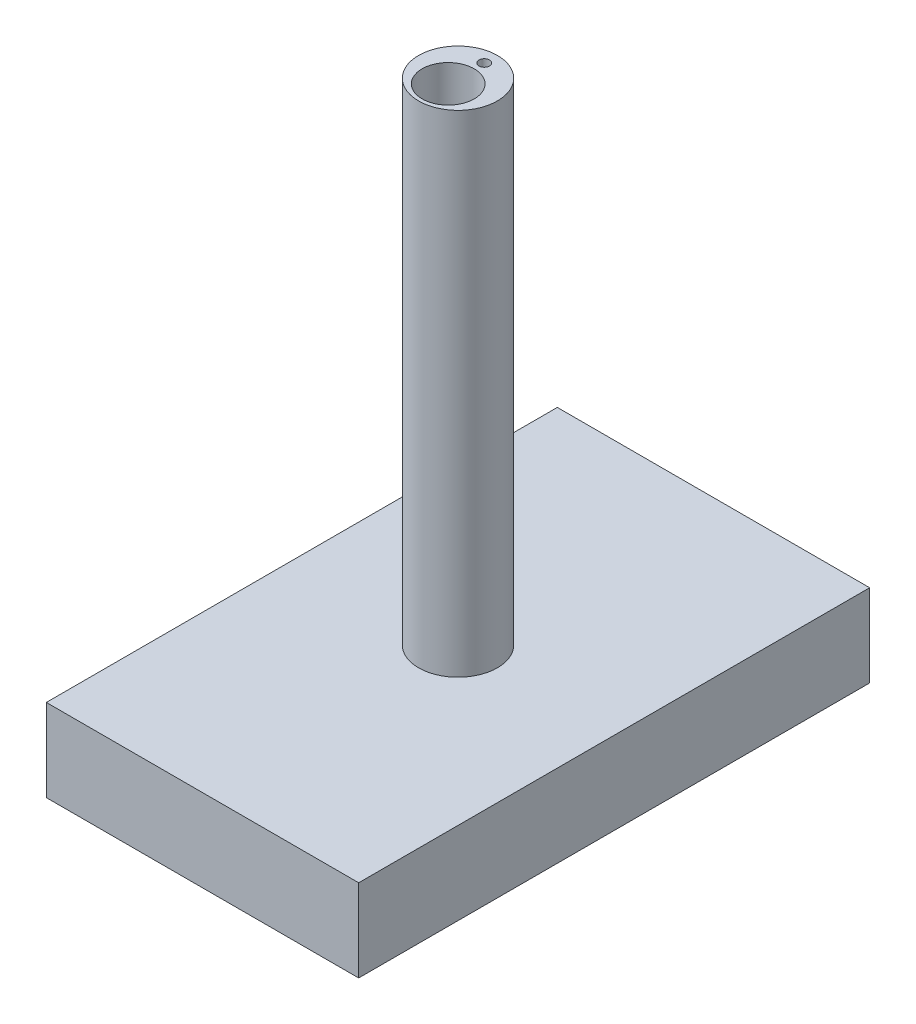
ISO-10303-21;
HEADER;
FILE_DESCRIPTION(('STEP AP214'),'2;1');
FILE_NAME('part.step','',(''),(''),'','','');
FILE_SCHEMA(('AUTOMOTIVE_DESIGN { 1 0 10303 214 1 1 1 1 }'));
ENDSEC;
DATA;
#1=APPLICATION_CONTEXT('core data for automotive mechanical design processes');
#2=APPLICATION_PROTOCOL_DEFINITION('international standard','automotive_design',2000,#1);
#3=PRODUCT_CONTEXT('',#1,'mechanical');
#4=PRODUCT('Part','Part','',(#3));
#5=PRODUCT_RELATED_PRODUCT_CATEGORY('part','',(#4));
#6=PRODUCT_DEFINITION_FORMATION('','',#4);
#7=PRODUCT_DEFINITION_CONTEXT('part definition',#1,'design');
#8=PRODUCT_DEFINITION('design','',#6,#7);
#9=PRODUCT_DEFINITION_SHAPE('','',#8);
#10=(LENGTH_UNIT() NAMED_UNIT(*) SI_UNIT(.MILLI.,.METRE.));
#11=(NAMED_UNIT(*) PLANE_ANGLE_UNIT() SI_UNIT($,.RADIAN.));
#12=(NAMED_UNIT(*) SI_UNIT($,.STERADIAN.) SOLID_ANGLE_UNIT());
#13=UNCERTAINTY_MEASURE_WITH_UNIT(LENGTH_MEASURE(1.E-05),#10,'distance_accuracy_value','');
#14=(GEOMETRIC_REPRESENTATION_CONTEXT(3) GLOBAL_UNCERTAINTY_ASSIGNED_CONTEXT((#13)) GLOBAL_UNIT_ASSIGNED_CONTEXT((#10,
#11,#12)) REPRESENTATION_CONTEXT('',''));
#15=CARTESIAN_POINT('',(0.,0.,0.));
#16=DIRECTION('',(0.,0.,1.));
#17=DIRECTION('',(1.,0.,0.));
#18=AXIS2_PLACEMENT_3D('',#15,#16,#17);
#19=CARTESIAN_POINT('',(-30.5,-20.,-146.689999926077));
#20=DIRECTION('',(0.,0.,-1.));
#21=DIRECTION('',(-1.,0.,0.));
#22=AXIS2_PLACEMENT_3D('',#19,#20,#21);
#23=PLANE('',#22);
#24=DIRECTION('',(1.,0.,0.));
#25=VECTOR('',#24,1.);
#26=CARTESIAN_POINT('',(29.5,-14.,-146.689999926077));
#27=LINE('',#26,#25);
#28=CARTESIAN_POINT('',(29.5,-14.,-146.689999926077));
#29=VERTEX_POINT('',#28);
#30=CARTESIAN_POINT('',(30.5,-14.,-146.689999926077));
#31=VERTEX_POINT('',#30);
#32=EDGE_CURVE('E232',#29,#31,#27,.T.);
#33=ORIENTED_EDGE('',*,*,#32,.T.);
#34=DIRECTION('',(0.,1.,0.));
#35=VECTOR('',#34,1.);
#36=CARTESIAN_POINT('',(30.5,-20.,-146.689999926077));
#37=LINE('',#36,#35);
#38=CARTESIAN_POINT('',(30.5,-10.,-146.689999926077));
#39=VERTEX_POINT('',#38);
#40=EDGE_CURVE('E412',#31,#39,#37,.T.);
#41=ORIENTED_EDGE('',*,*,#40,.T.);
#42=DIRECTION('',(-1.,0.,0.));
#43=VECTOR('',#42,1.);
#44=CARTESIAN_POINT('',(-30.5,-10.,-146.689999926077));
#45=LINE('',#44,#43);
#46=CARTESIAN_POINT('',(-30.5,-10.,-146.689999926077));
#47=VERTEX_POINT('',#46);
#48=EDGE_CURVE('E375',#39,#47,#45,.T.);
#49=ORIENTED_EDGE('',*,*,#48,.T.);
#50=DIRECTION('',(0.,1.,0.));
#51=VECTOR('',#50,1.);
#52=CARTESIAN_POINT('',(-30.5,-20.,-146.689999926077));
#53=LINE('',#52,#51);
#54=CARTESIAN_POINT('',(-30.5,-14.,-146.689999926077));
#55=VERTEX_POINT('',#54);
#56=EDGE_CURVE('E407',#55,#47,#53,.T.);
#57=ORIENTED_EDGE('',*,*,#56,.F.);
#58=DIRECTION('',(-1.,0.,0.));
#59=VECTOR('',#58,1.);
#60=CARTESIAN_POINT('',(-29.5,-14.,-146.689999926077));
#61=LINE('',#60,#59);
#62=CARTESIAN_POINT('',(-29.5,-14.,-146.689999926077));
#63=VERTEX_POINT('',#62);
#64=EDGE_CURVE('E304',#63,#55,#61,.T.);
#65=ORIENTED_EDGE('',*,*,#64,.F.);
#66=DIRECTION('',(0.,1.,0.));
#67=VECTOR('',#66,1.);
#68=CARTESIAN_POINT('',(-29.5,-15.,-146.689999926077));
#69=LINE('',#68,#67);
#70=CARTESIAN_POINT('',(-29.5,-15.,-146.689999926077));
#71=VERTEX_POINT('',#70);
#72=EDGE_CURVE('E290',#71,#63,#69,.T.);
#73=ORIENTED_EDGE('',*,*,#72,.F.);
#74=DIRECTION('',(-1.,0.,0.));
#75=VECTOR('',#74,1.);
#76=CARTESIAN_POINT('',(-29.5,-15.,-146.689999926077));
#77=LINE('',#76,#75);
#78=CARTESIAN_POINT('',(-30.5,-15.,-146.689999926077));
#79=VERTEX_POINT('',#78);
#80=EDGE_CURVE('E307',#71,#79,#77,.T.);
#81=ORIENTED_EDGE('',*,*,#80,.T.);
#82=CARTESIAN_POINT('',(-30.5,-19.,-146.689999926077));
#83=VERTEX_POINT('',#82);
#84=EDGE_CURVE('E408',#83,#79,#53,.T.);
#85=ORIENTED_EDGE('',*,*,#84,.F.);
#86=DIRECTION('',(-1.,0.,0.));
#87=VECTOR('',#86,1.);
#88=CARTESIAN_POINT('',(-29.5,-19.,-146.689999926077));
#89=LINE('',#88,#87);
#90=CARTESIAN_POINT('',(-29.5,-19.,-146.689999926077));
#91=VERTEX_POINT('',#90);
#92=EDGE_CURVE('E336',#91,#83,#89,.T.);
#93=ORIENTED_EDGE('',*,*,#92,.F.);
#94=DIRECTION('',(0.,1.,0.));
#95=VECTOR('',#94,1.);
#96=CARTESIAN_POINT('',(-29.5,-20.,-146.689999926077));
#97=LINE('',#96,#95);
#98=CARTESIAN_POINT('',(-29.5,-20.,-146.689999926077));
#99=VERTEX_POINT('',#98);
#100=EDGE_CURVE('E315',#99,#91,#97,.T.);
#101=ORIENTED_EDGE('',*,*,#100,.F.);
#102=DIRECTION('',(-1.,0.,0.));
#103=VECTOR('',#102,1.);
#104=CARTESIAN_POINT('',(-30.5,-20.,-146.689999926077));
#105=LINE('',#104,#103);
#106=CARTESIAN_POINT('',(29.5,-20.,-146.689999926077));
#107=VERTEX_POINT('',#106);
#108=EDGE_CURVE('E351',#107,#99,#105,.T.);
#109=ORIENTED_EDGE('',*,*,#108,.F.);
#110=DIRECTION('',(0.,-1.,0.));
#111=VECTOR('',#110,1.);
#112=CARTESIAN_POINT('',(29.5,-20.,-146.689999926077));
#113=LINE('',#112,#111);
#114=CARTESIAN_POINT('',(29.5,-19.,-146.689999926077));
#115=VERTEX_POINT('',#114);
#116=EDGE_CURVE('E256',#115,#107,#113,.T.);
#117=ORIENTED_EDGE('',*,*,#116,.F.);
#118=DIRECTION('',(1.,0.,0.));
#119=VECTOR('',#118,1.);
#120=CARTESIAN_POINT('',(29.5,-19.,-146.689999926077));
#121=LINE('',#120,#119);
#122=CARTESIAN_POINT('',(30.5,-19.,-146.689999926077));
#123=VERTEX_POINT('',#122);
#124=EDGE_CURVE('E273',#115,#123,#121,.T.);
#125=ORIENTED_EDGE('',*,*,#124,.T.);
#126=CARTESIAN_POINT('',(30.5,-15.,-146.689999926077));
#127=VERTEX_POINT('',#126);
#128=EDGE_CURVE('E413',#123,#127,#37,.T.);
#129=ORIENTED_EDGE('',*,*,#128,.T.);
#130=DIRECTION('',(1.,0.,0.));
#131=VECTOR('',#130,1.);
#132=CARTESIAN_POINT('',(29.5,-15.,-146.689999926077));
#133=LINE('',#132,#131);
#134=CARTESIAN_POINT('',(29.5,-15.,-146.689999926077));
#135=VERTEX_POINT('',#134);
#136=EDGE_CURVE('E62',#135,#127,#133,.T.);
#137=ORIENTED_EDGE('',*,*,#136,.F.);
#138=DIRECTION('',(0.,-1.,0.));
#139=VECTOR('',#138,1.);
#140=CARTESIAN_POINT('',(29.5,-15.,-146.689999926077));
#141=LINE('',#140,#139);
#142=EDGE_CURVE('E57',#29,#135,#141,.T.);
#143=ORIENTED_EDGE('',*,*,#142,.F.);
#144=EDGE_LOOP('',(#33,#41,#49,#57,#65,#73,#81,#85,#93,#101,#109,#117,#125,#129,#137,#143));
#145=FACE_BOUND('',#144,.T.);
#146=ADVANCED_FACE('F39',(#145),#23,.F.);
#147=CARTESIAN_POINT('',(30.5,-20.,-69.1899999260768));
#148=DIRECTION('',(1.,0.,0.));
#149=DIRECTION('',(0.,0.,-1.));
#150=AXIS2_PLACEMENT_3D('',#147,#148,#149);
#151=PLANE('',#150);
#152=DIRECTION('',(0.,0.,-1.));
#153=VECTOR('',#152,1.);
#154=CARTESIAN_POINT('',(30.5,-14.,-69.1899999260768));
#155=LINE('',#154,#153);
#156=CARTESIAN_POINT('',(30.5,-14.,-69.1899999260768));
#157=VERTEX_POINT('',#156);
#158=EDGE_CURVE('E584',#157,#31,#155,.T.);
#159=ORIENTED_EDGE('',*,*,#158,.F.);
#160=DIRECTION('',(0.,1.,0.));
#161=VECTOR('',#160,1.);
#162=CARTESIAN_POINT('',(30.5,-20.,-69.1899999260768));
#163=LINE('',#162,#161);
#164=CARTESIAN_POINT('',(30.5,-10.,-69.1899999260768));
#165=VERTEX_POINT('',#164);
#166=EDGE_CURVE('E249',#157,#165,#163,.T.);
#167=ORIENTED_EDGE('',*,*,#166,.T.);
#168=DIRECTION('',(0.,0.,-1.));
#169=VECTOR('',#168,1.);
#170=CARTESIAN_POINT('',(30.5,-10.,-69.1899999260768));
#171=LINE('',#170,#169);
#172=EDGE_CURVE('E371',#165,#39,#171,.T.);
#173=ORIENTED_EDGE('',*,*,#172,.T.);
#174=ORIENTED_EDGE('',*,*,#40,.F.);
#175=EDGE_LOOP('',(#159,#167,#173,#174));
#176=FACE_BOUND('',#175,.T.);
#177=ADVANCED_FACE('F583',(#176),#151,.F.);
#178=DIRECTION('',(0.,0.,1.));
#179=VECTOR('',#178,1.);
#180=CARTESIAN_POINT('',(30.5,-15.,-69.1899999260768));
#181=LINE('',#180,#179);
#182=CARTESIAN_POINT('',(30.5,-15.,-69.1899999260768));
#183=VERTEX_POINT('',#182);
#184=EDGE_CURVE('E245',#127,#183,#181,.T.);
#185=ORIENTED_EDGE('',*,*,#184,.F.);
#186=ORIENTED_EDGE('',*,*,#128,.F.);
#187=DIRECTION('',(0.,0.,-1.));
#188=VECTOR('',#187,1.);
#189=CARTESIAN_POINT('',(30.5,-19.,-146.689999926077));
#190=LINE('',#189,#188);
#191=CARTESIAN_POINT('',(30.5,-19.,-69.1899999260768));
#192=VERTEX_POINT('',#191);
#193=EDGE_CURVE('E252',#192,#123,#190,.T.);
#194=ORIENTED_EDGE('',*,*,#193,.F.);
#195=EDGE_CURVE('E416',#192,#183,#163,.T.);
#196=ORIENTED_EDGE('',*,*,#195,.T.);
#197=EDGE_LOOP('',(#185,#186,#194,#196));
#198=FACE_BOUND('',#197,.T.);
#199=ADVANCED_FACE('F615',(#198),#151,.F.);
#200=CARTESIAN_POINT('',(-30.5,-20.,-146.689999926077));
#201=DIRECTION('',(-1.,0.,0.));
#202=DIRECTION('',(0.,0.,1.));
#203=AXIS2_PLACEMENT_3D('',#200,#201,#202);
#204=PLANE('',#203);
#205=DIRECTION('',(0.,0.,-1.));
#206=VECTOR('',#205,1.);
#207=CARTESIAN_POINT('',(-30.5,-15.,-109.189999926077));
#208=LINE('',#207,#206);
#209=CARTESIAN_POINT('',(-30.5,-15.,-109.189999926077));
#210=VERTEX_POINT('',#209);
#211=EDGE_CURVE('E281',#210,#79,#208,.T.);
#212=ORIENTED_EDGE('',*,*,#211,.F.);
#213=DIRECTION('',(0.,1.,0.));
#214=VECTOR('',#213,1.);
#215=CARTESIAN_POINT('',(-30.5,-20.,-109.189999926077));
#216=LINE('',#215,#214);
#217=CARTESIAN_POINT('',(-30.5,-19.,-109.189999926077));
#218=VERTEX_POINT('',#217);
#219=EDGE_CURVE('E403',#218,#210,#216,.T.);
#220=ORIENTED_EDGE('',*,*,#219,.F.);
#221=DIRECTION('',(0.,0.,1.));
#222=VECTOR('',#221,1.);
#223=CARTESIAN_POINT('',(-30.5,-19.,-146.689999926077));
#224=LINE('',#223,#222);
#225=EDGE_CURVE('E314',#83,#218,#224,.T.);
#226=ORIENTED_EDGE('',*,*,#225,.F.);
#227=ORIENTED_EDGE('',*,*,#84,.T.);
#228=EDGE_LOOP('',(#212,#220,#226,#227));
#229=FACE_BOUND('',#228,.T.);
#230=ADVANCED_FACE('F618',(#229),#204,.F.);
#231=DIRECTION('',(0.,0.,1.));
#232=VECTOR('',#231,1.);
#233=CARTESIAN_POINT('',(-30.5,-14.,-109.189999926077));
#234=LINE('',#233,#232);
#235=CARTESIAN_POINT('',(-30.5,-14.,-109.189999926077));
#236=VERTEX_POINT('',#235);
#237=EDGE_CURVE('E287',#55,#236,#234,.T.);
#238=ORIENTED_EDGE('',*,*,#237,.F.);
#239=ORIENTED_EDGE('',*,*,#56,.T.);
#240=DIRECTION('',(0.,0.,1.));
#241=VECTOR('',#240,1.);
#242=CARTESIAN_POINT('',(-30.5,-10.,-146.689999926077));
#243=LINE('',#242,#241);
#244=CARTESIAN_POINT('',(-30.5,-10.,-109.189999926077));
#245=VERTEX_POINT('',#244);
#246=EDGE_CURVE('E379',#47,#245,#243,.T.);
#247=ORIENTED_EDGE('',*,*,#246,.T.);
#248=EDGE_CURVE('E402',#236,#245,#216,.T.);
#249=ORIENTED_EDGE('',*,*,#248,.F.);
#250=EDGE_LOOP('',(#238,#239,#247,#249));
#251=FACE_BOUND('',#250,.T.);
#252=ADVANCED_FACE('F541',(#251),#204,.F.);
#253=CARTESIAN_POINT('',(0.,-10.,0.));
#254=DIRECTION('',(0.,-1.,0.));
#255=DIRECTION('',(0.,0.,-1.));
#256=AXIS2_PLACEMENT_3D('',#253,#254,#255);
#257=PLANE('',#256);
#258=CARTESIAN_POINT('',(0.,-10.,-18.75));
#259=DIRECTION('',(0.,-1.,0.));
#260=DIRECTION('',(0.,0.,-1.));
#261=AXIS2_PLACEMENT_3D('',#258,#259,#260);
#262=CIRCLE('',#261,3.75);
#263=CARTESIAN_POINT('',(0.,-10.,-22.5));
#264=VERTEX_POINT('',#263);
#265=EDGE_CURVE('E426',#264,#264,#262,.T.);
#266=ORIENTED_EDGE('',*,*,#265,.F.);
#267=EDGE_LOOP('',(#266));
#268=FACE_BOUND('',#267,.T.);
#269=CARTESIAN_POINT('',(0.,-10.,7.));
#270=DIRECTION('',(0.,-1.,0.));
#271=DIRECTION('',(0.,0.,-1.));
#272=AXIS2_PLACEMENT_3D('',#269,#270,#271);
#273=CIRCLE('',#272,16.1);
#274=CARTESIAN_POINT('',(0.,-10.,-9.1));
#275=VERTEX_POINT('',#274);
#276=EDGE_CURVE('E431',#275,#275,#273,.T.);
#277=ORIENTED_EDGE('',*,*,#276,.F.);
#278=EDGE_LOOP('',(#277));
#279=FACE_BOUND('',#278,.T.);
#280=DIRECTION('',(0.,0.,1.));
#281=VECTOR('',#280,1.);
#282=CARTESIAN_POINT('',(103.958701758156,-10.,174.272148859892));
#283=LINE('',#282,#281);
#284=CARTESIAN_POINT('',(103.958701758156,-10.,-174.272148859892));
#285=VERTEX_POINT('',#284);
#286=CARTESIAN_POINT('',(103.958701758156,-10.,174.272148859892));
#287=VERTEX_POINT('',#286);
#288=EDGE_CURVE('E432',#285,#287,#283,.T.);
#289=ORIENTED_EDGE('',*,*,#288,.T.);
#290=DIRECTION('',(-1.,0.,0.));
#291=VECTOR('',#290,1.);
#292=CARTESIAN_POINT('',(-103.958701758156,-10.,174.272148859892));
#293=LINE('',#292,#291);
#294=CARTESIAN_POINT('',(-103.958701758156,-10.,174.272148859892));
#295=VERTEX_POINT('',#294);
#296=EDGE_CURVE('E436',#287,#295,#293,.T.);
#297=ORIENTED_EDGE('',*,*,#296,.T.);
#298=DIRECTION('',(0.,0.,-1.));
#299=VECTOR('',#298,1.);
#300=CARTESIAN_POINT('',(-103.958701758156,-10.,174.272148859892));
#301=LINE('',#300,#299);
#302=CARTESIAN_POINT('',(-103.958701758156,-10.,-174.272148859892));
#303=VERTEX_POINT('',#302);
#304=EDGE_CURVE('E441',#295,#303,#301,.T.);
#305=ORIENTED_EDGE('',*,*,#304,.T.);
#306=DIRECTION('',(1.,0.,0.));
#307=VECTOR('',#306,1.);
#308=CARTESIAN_POINT('',(-103.958701758156,-10.,-174.272148859892));
#309=LINE('',#308,#307);
#310=EDGE_CURVE('E445',#303,#285,#309,.T.);
#311=ORIENTED_EDGE('',*,*,#310,.T.);
#312=EDGE_LOOP('',(#289,#297,#305,#311));
#313=FACE_BOUND('',#312,.T.);
#314=DIRECTION('',(-1.,0.,0.));
#315=VECTOR('',#314,1.);
#316=CARTESIAN_POINT('',(33.,-10.,-69.1899999260768));
#317=LINE('',#316,#315);
#318=CARTESIAN_POINT('',(33.,-10.,-69.1899999260768));
#319=VERTEX_POINT('',#318);
#320=EDGE_CURVE('E368',#319,#165,#317,.T.);
#321=ORIENTED_EDGE('',*,*,#320,.F.);
#322=DIRECTION('',(0.,0.,1.));
#323=VECTOR('',#322,1.);
#324=CARTESIAN_POINT('',(33.,-10.,-149.189999926077));
#325=LINE('',#324,#323);
#326=CARTESIAN_POINT('',(33.,-10.,-149.189999926077));
#327=VERTEX_POINT('',#326);
#328=EDGE_CURVE('E364',#327,#319,#325,.T.);
#329=ORIENTED_EDGE('',*,*,#328,.F.);
#330=DIRECTION('',(1.,0.,0.));
#331=VECTOR('',#330,1.);
#332=CARTESIAN_POINT('',(-33.,-10.,-149.189999926077));
#333=LINE('',#332,#331);
#334=CARTESIAN_POINT('',(-33.,-10.,-149.189999926077));
#335=VERTEX_POINT('',#334);
#336=EDGE_CURVE('E348',#335,#327,#333,.T.);
#337=ORIENTED_EDGE('',*,*,#336,.F.);
#338=DIRECTION('',(0.,0.,-1.));
#339=VECTOR('',#338,1.);
#340=CARTESIAN_POINT('',(-33.,-10.,-109.189999926077));
#341=LINE('',#340,#339);
#342=CARTESIAN_POINT('',(-33.,-10.,-109.189999926077));
#343=VERTEX_POINT('',#342);
#344=EDGE_CURVE('E386',#343,#335,#341,.T.);
#345=ORIENTED_EDGE('',*,*,#344,.F.);
#346=DIRECTION('',(-1.,0.,0.));
#347=VECTOR('',#346,1.);
#348=CARTESIAN_POINT('',(-30.5,-10.,-109.189999926077));
#349=LINE('',#348,#347);
#350=EDGE_CURVE('E383',#245,#343,#349,.T.);
#351=ORIENTED_EDGE('',*,*,#350,.F.);
#352=ORIENTED_EDGE('',*,*,#246,.F.);
#353=ORIENTED_EDGE('',*,*,#48,.F.);
#354=ORIENTED_EDGE('',*,*,#172,.F.);
#355=EDGE_LOOP('',(#321,#329,#337,#345,#351,#352,#353,#354));
#356=FACE_BOUND('',#355,.T.);
#357=ADVANCED_FACE('F538',(#268,#279,#313,#356),#257,.T.);
#358=CARTESIAN_POINT('',(0.,350.,0.));
#359=DIRECTION('',(0.,-1.,0.));
#360=DIRECTION('',(0.,0.,-1.));
#361=AXIS2_PLACEMENT_3D('',#358,#359,#360);
#362=CYLINDRICAL_SURFACE('',#361,28.1);
#363=CARTESIAN_POINT('',(0.,350.,0.));
#364=DIRECTION('',(0.,1.,0.));
#365=DIRECTION('',(0.,0.,1.));
#366=AXIS2_PLACEMENT_3D('',#363,#364,#365);
#367=CIRCLE('',#366,28.1);
#368=CARTESIAN_POINT('',(0.,350.,28.1));
#369=VERTEX_POINT('',#368);
#370=EDGE_CURVE('E11',#369,#369,#367,.T.);
#371=ORIENTED_EDGE('',*,*,#370,.F.);
#372=EDGE_LOOP('',(#371));
#373=FACE_BOUND('',#372,.T.);
#374=CARTESIAN_POINT('',(0.,0.,0.));
#375=DIRECTION('',(0.,1.,0.));
#376=DIRECTION('',(0.,0.,1.));
#377=AXIS2_PLACEMENT_3D('',#374,#375,#376);
#378=CIRCLE('',#377,28.1);
#379=CARTESIAN_POINT('',(0.,0.,28.1));
#380=VERTEX_POINT('',#379);
#381=EDGE_CURVE('E518',#380,#380,#378,.T.);
#382=ORIENTED_EDGE('',*,*,#381,.T.);
#383=EDGE_LOOP('',(#382));
#384=FACE_BOUND('',#383,.T.);
#385=ADVANCED_FACE('F41',(#373,#384),#362,.T.);
#386=CARTESIAN_POINT('',(0.,350.,0.));
#387=DIRECTION('',(0.,1.,0.));
#388=DIRECTION('',(0.,0.,1.));
#389=AXIS2_PLACEMENT_3D('',#386,#387,#388);
#390=PLANE('',#389);
#391=CARTESIAN_POINT('',(0.,350.,-18.75));
#392=DIRECTION('',(0.,1.,0.));
#393=DIRECTION('',(0.,0.,1.));
#394=AXIS2_PLACEMENT_3D('',#391,#392,#393);
#395=CIRCLE('',#394,3.75);
#396=CARTESIAN_POINT('',(0.,350.,-15.));
#397=VERTEX_POINT('',#396);
#398=EDGE_CURVE('E422',#397,#397,#395,.T.);
#399=ORIENTED_EDGE('',*,*,#398,.F.);
#400=EDGE_LOOP('',(#399));
#401=FACE_BOUND('',#400,.T.);
#402=CARTESIAN_POINT('',(0.,350.,7.));
#403=DIRECTION('',(0.,1.,0.));
#404=DIRECTION('',(0.,0.,1.));
#405=AXIS2_PLACEMENT_3D('',#402,#403,#404);
#406=CIRCLE('',#405,18.6);
#407=CARTESIAN_POINT('',(0.,350.,25.6));
#408=VERTEX_POINT('',#407);
#409=EDGE_CURVE('E522',#408,#408,#406,.T.);
#410=ORIENTED_EDGE('',*,*,#409,.F.);
#411=EDGE_LOOP('',(#410));
#412=FACE_BOUND('',#411,.T.);
#413=ORIENTED_EDGE('',*,*,#370,.T.);
#414=EDGE_LOOP('',(#413));
#415=FACE_BOUND('',#414,.T.);
#416=ADVANCED_FACE('F675',(#401,#412,#415),#390,.T.);
#417=CARTESIAN_POINT('',(0.,291.2,7.));
#418=DIRECTION('',(0.,1.,0.));
#419=DIRECTION('',(0.,0.,1.));
#420=AXIS2_PLACEMENT_3D('',#417,#418,#419);
#421=CYLINDRICAL_SURFACE('',#420,18.6);
#422=CARTESIAN_POINT('',(0.,291.2,7.));
#423=DIRECTION('',(0.,1.,0.));
#424=DIRECTION('',(0.,0.,1.));
#425=AXIS2_PLACEMENT_3D('',#422,#423,#424);
#426=CIRCLE('',#425,18.6);
#427=CARTESIAN_POINT('',(0.,291.2,25.6));
#428=VERTEX_POINT('',#427);
#429=EDGE_CURVE('E49',#428,#428,#426,.T.);
#430=ORIENTED_EDGE('',*,*,#429,.F.);
#431=EDGE_LOOP('',(#430));
#432=FACE_BOUND('',#431,.T.);
#433=ORIENTED_EDGE('',*,*,#409,.T.);
#434=EDGE_LOOP('',(#433));
#435=FACE_BOUND('',#434,.T.);
#436=ADVANCED_FACE('F672',(#432,#435),#421,.F.);
#437=CARTESIAN_POINT('',(0.,291.2,7.));
#438=DIRECTION('',(0.,1.,0.));
#439=DIRECTION('',(0.,0.,1.));
#440=AXIS2_PLACEMENT_3D('',#437,#438,#439);
#441=PLANE('',#440);
#442=CARTESIAN_POINT('',(0.,291.2,7.));
#443=DIRECTION('',(0.,1.,0.));
#444=DIRECTION('',(0.,0.,1.));
#445=AXIS2_PLACEMENT_3D('',#442,#443,#444);
#446=CIRCLE('',#445,16.1);
#447=CARTESIAN_POINT('',(0.,291.2,23.1));
#448=VERTEX_POINT('',#447);
#449=EDGE_CURVE('E427',#448,#448,#446,.T.);
#450=ORIENTED_EDGE('',*,*,#449,.F.);
#451=EDGE_LOOP('',(#450));
#452=FACE_BOUND('',#451,.T.);
#453=ORIENTED_EDGE('',*,*,#429,.T.);
#454=EDGE_LOOP('',(#453));
#455=FACE_BOUND('',#454,.T.);
#456=ADVANCED_FACE('F668',(#452,#455),#441,.T.);
#457=CARTESIAN_POINT('',(111.341546011374,-58.8,182.141376200391));
#458=DIRECTION('',(-1.,0.,0.));
#459=DIRECTION('',(0.,0.,1.));
#460=AXIS2_PLACEMENT_3D('',#457,#458,#459);
#461=PLANE('',#460);
#462=DIRECTION('',(0.,0.,1.));
#463=VECTOR('',#462,1.);
#464=CARTESIAN_POINT('',(111.341546011374,0.,182.141376200391));
#465=LINE('',#464,#463);
#466=CARTESIAN_POINT('',(111.341546011374,0.,-182.141376200391));
#467=VERTEX_POINT('',#466);
#468=CARTESIAN_POINT('',(111.341546011374,0.,182.141376200391));
#469=VERTEX_POINT('',#468);
#470=EDGE_CURVE('E467',#467,#469,#465,.T.);
#471=ORIENTED_EDGE('',*,*,#470,.T.);
#472=DIRECTION('',(0.,1.,0.));
#473=VECTOR('',#472,1.);
#474=CARTESIAN_POINT('',(111.341546011374,-58.8,182.141376200391));
#475=LINE('',#474,#473);
#476=CARTESIAN_POINT('',(111.341546011374,-58.8,182.141376200391));
#477=VERTEX_POINT('',#476);
#478=EDGE_CURVE('E514',#477,#469,#475,.T.);
#479=ORIENTED_EDGE('',*,*,#478,.F.);
#480=DIRECTION('',(0.,0.,1.));
#481=VECTOR('',#480,1.);
#482=CARTESIAN_POINT('',(111.341546011374,-58.8,182.141376200391));
#483=LINE('',#482,#481);
#484=CARTESIAN_POINT('',(111.341546011374,-58.8,-182.141376200391));
#485=VERTEX_POINT('',#484);
#486=EDGE_CURVE('E477',#485,#477,#483,.T.);
#487=ORIENTED_EDGE('',*,*,#486,.F.);
#488=DIRECTION('',(0.,1.,0.));
#489=VECTOR('',#488,1.);
#490=CARTESIAN_POINT('',(111.341546011374,-58.8,-182.141376200391));
#491=LINE('',#490,#489);
#492=EDGE_CURVE('E491',#485,#467,#491,.T.);
#493=ORIENTED_EDGE('',*,*,#492,.T.);
#494=EDGE_LOOP('',(#471,#479,#487,#493));
#495=FACE_BOUND('',#494,.T.);
#496=ADVANCED_FACE('F664',(#495),#461,.F.);
#497=CARTESIAN_POINT('',(-111.341546011374,-58.8,182.141376200391));
#498=DIRECTION('',(0.,0.,-1.));
#499=DIRECTION('',(-1.,0.,0.));
#500=AXIS2_PLACEMENT_3D('',#497,#498,#499);
#501=PLANE('',#500);
#502=DIRECTION('',(-1.,0.,0.));
#503=VECTOR('',#502,1.);
#504=CARTESIAN_POINT('',(-111.341546011374,0.,182.141376200391));
#505=LINE('',#504,#503);
#506=CARTESIAN_POINT('',(-111.341546011374,0.,182.141376200391));
#507=VERTEX_POINT('',#506);
#508=EDGE_CURVE('E495',#469,#507,#505,.T.);
#509=ORIENTED_EDGE('',*,*,#508,.T.);
#510=DIRECTION('',(0.,1.,0.));
#511=VECTOR('',#510,1.);
#512=CARTESIAN_POINT('',(-111.341546011374,-58.8,182.141376200391));
#513=LINE('',#512,#511);
#514=CARTESIAN_POINT('',(-111.341546011374,-58.8,182.141376200391));
#515=VERTEX_POINT('',#514);
#516=EDGE_CURVE('E510',#515,#507,#513,.T.);
#517=ORIENTED_EDGE('',*,*,#516,.F.);
#518=DIRECTION('',(-1.,0.,0.));
#519=VECTOR('',#518,1.);
#520=CARTESIAN_POINT('',(-111.341546011374,-58.8,182.141376200391));
#521=LINE('',#520,#519);
#522=EDGE_CURVE('E481',#477,#515,#521,.T.);
#523=ORIENTED_EDGE('',*,*,#522,.F.);
#524=ORIENTED_EDGE('',*,*,#478,.T.);
#525=EDGE_LOOP('',(#509,#517,#523,#524));
#526=FACE_BOUND('',#525,.T.);
#527=ADVANCED_FACE('F660',(#526),#501,.F.);
#528=CARTESIAN_POINT('',(-111.341546011374,-58.8,182.141376200391));
#529=DIRECTION('',(1.,0.,0.));
#530=DIRECTION('',(0.,0.,-1.));
#531=AXIS2_PLACEMENT_3D('',#528,#529,#530);
#532=PLANE('',#531);
#533=DIRECTION('',(0.,0.,-1.));
#534=VECTOR('',#533,1.);
#535=CARTESIAN_POINT('',(-111.341546011374,0.,182.141376200391));
#536=LINE('',#535,#534);
#537=CARTESIAN_POINT('',(-111.341546011374,0.,-182.141376200391));
#538=VERTEX_POINT('',#537);
#539=EDGE_CURVE('E498',#507,#538,#536,.T.);
#540=ORIENTED_EDGE('',*,*,#539,.T.);
#541=DIRECTION('',(0.,1.,0.));
#542=VECTOR('',#541,1.);
#543=CARTESIAN_POINT('',(-111.341546011374,-58.8,-182.141376200391));
#544=LINE('',#543,#542);
#545=CARTESIAN_POINT('',(-111.341546011374,-58.8,-182.141376200391));
#546=VERTEX_POINT('',#545);
#547=EDGE_CURVE('E506',#546,#538,#544,.T.);
#548=ORIENTED_EDGE('',*,*,#547,.F.);
#549=DIRECTION('',(0.,0.,-1.));
#550=VECTOR('',#549,1.);
#551=CARTESIAN_POINT('',(-111.341546011374,-58.8,182.141376200391));
#552=LINE('',#551,#550);
#553=EDGE_CURVE('E485',#515,#546,#552,.T.);
#554=ORIENTED_EDGE('',*,*,#553,.F.);
#555=ORIENTED_EDGE('',*,*,#516,.T.);
#556=EDGE_LOOP('',(#540,#548,#554,#555));
#557=FACE_BOUND('',#556,.T.);
#558=ADVANCED_FACE('F656',(#557),#532,.F.);
#559=CARTESIAN_POINT('',(-111.341546011374,-58.8,-182.141376200391));
#560=DIRECTION('',(0.,0.,1.));
#561=DIRECTION('',(1.,0.,0.));
#562=AXIS2_PLACEMENT_3D('',#559,#560,#561);
#563=PLANE('',#562);
#564=CARTESIAN_POINT('',(86.5736717664163,-25.0111553348233,-182.141376200391));
#565=DIRECTION('',(0.,0.,-1.));
#566=DIRECTION('',(-1.,0.,0.));
#567=AXIS2_PLACEMENT_3D('',#564,#565,#566);
#568=CIRCLE('',#567,9.99999999999999);
#569=CARTESIAN_POINT('',(76.5736717664163,-25.0111553348233,-182.141376200391));
#570=VERTEX_POINT('',#569);
#571=EDGE_CURVE('E339',#570,#570,#568,.T.);
#572=ORIENTED_EDGE('',*,*,#571,.F.);
#573=EDGE_LOOP('',(#572));
#574=FACE_BOUND('',#573,.T.);
#575=DIRECTION('',(1.,0.,0.));
#576=VECTOR('',#575,1.);
#577=CARTESIAN_POINT('',(-111.341546011374,0.,-182.141376200391));
#578=LINE('',#577,#576);
#579=EDGE_CURVE('E482',#538,#467,#578,.T.);
#580=ORIENTED_EDGE('',*,*,#579,.T.);
#581=ORIENTED_EDGE('',*,*,#492,.F.);
#582=DIRECTION('',(1.,0.,0.));
#583=VECTOR('',#582,1.);
#584=CARTESIAN_POINT('',(-111.341546011374,-58.8,-182.141376200391));
#585=LINE('',#584,#583);
#586=EDGE_CURVE('E488',#546,#485,#585,.T.);
#587=ORIENTED_EDGE('',*,*,#586,.F.);
#588=ORIENTED_EDGE('',*,*,#547,.T.);
#589=EDGE_LOOP('',(#580,#581,#587,#588));
#590=FACE_BOUND('',#589,.T.);
#591=ADVANCED_FACE('F649',(#574,#590),#563,.F.);
#592=CARTESIAN_POINT('',(0.,-58.8,0.));
#593=DIRECTION('',(0.,-1.,0.));
#594=DIRECTION('',(0.,0.,-1.));
#595=AXIS2_PLACEMENT_3D('',#592,#593,#594);
#596=PLANE('',#595);
#597=DIRECTION('',(0.,0.,1.));
#598=VECTOR('',#597,1.);
#599=CARTESIAN_POINT('',(103.958701758156,-58.8,174.272148859892));
#600=LINE('',#599,#598);
#601=CARTESIAN_POINT('',(103.958701758156,-58.8,-174.272148859892));
#602=VERTEX_POINT('',#601);
#603=CARTESIAN_POINT('',(103.958701758156,-58.8,174.272148859892));
#604=VERTEX_POINT('',#603);
#605=EDGE_CURVE('E450',#602,#604,#600,.T.);
#606=ORIENTED_EDGE('',*,*,#605,.F.);
#607=DIRECTION('',(1.,0.,0.));
#608=VECTOR('',#607,1.);
#609=CARTESIAN_POINT('',(-103.958701758156,-58.8,-174.272148859892));
#610=LINE('',#609,#608);
#611=CARTESIAN_POINT('',(-103.958701758156,-58.8,-174.272148859892));
#612=VERTEX_POINT('',#611);
#613=EDGE_CURVE('E437',#612,#602,#610,.T.);
#614=ORIENTED_EDGE('',*,*,#613,.F.);
#615=DIRECTION('',(0.,0.,-1.));
#616=VECTOR('',#615,1.);
#617=CARTESIAN_POINT('',(-103.958701758156,-58.8,174.272148859892));
#618=LINE('',#617,#616);
#619=CARTESIAN_POINT('',(-103.958701758156,-58.8,174.272148859892));
#620=VERTEX_POINT('',#619);
#621=EDGE_CURVE('E457',#620,#612,#618,.T.);
#622=ORIENTED_EDGE('',*,*,#621,.F.);
#623=DIRECTION('',(-1.,0.,0.));
#624=VECTOR('',#623,1.);
#625=CARTESIAN_POINT('',(-103.958701758156,-58.8,174.272148859892));
#626=LINE('',#625,#624);
#627=EDGE_CURVE('E453',#604,#620,#626,.T.);
#628=ORIENTED_EDGE('',*,*,#627,.F.);
#629=EDGE_LOOP('',(#606,#614,#622,#628));
#630=FACE_BOUND('',#629,.T.);
#631=ORIENTED_EDGE('',*,*,#486,.T.);
#632=ORIENTED_EDGE('',*,*,#522,.T.);
#633=ORIENTED_EDGE('',*,*,#553,.T.);
#634=ORIENTED_EDGE('',*,*,#586,.T.);
#635=EDGE_LOOP('',(#631,#632,#633,#634));
#636=FACE_BOUND('',#635,.T.);
#637=ADVANCED_FACE('F646',(#630,#636),#596,.T.);
#638=CARTESIAN_POINT('',(0.,0.,0.));
#639=DIRECTION('',(0.,-1.,0.));
#640=DIRECTION('',(0.,0.,-1.));
#641=AXIS2_PLACEMENT_3D('',#638,#639,#640);
#642=PLANE('',#641);
#643=ORIENTED_EDGE('',*,*,#381,.F.);
#644=EDGE_LOOP('',(#643));
#645=FACE_BOUND('',#644,.T.);
#646=ORIENTED_EDGE('',*,*,#470,.F.);
#647=ORIENTED_EDGE('',*,*,#579,.F.);
#648=ORIENTED_EDGE('',*,*,#539,.F.);
#649=ORIENTED_EDGE('',*,*,#508,.F.);
#650=EDGE_LOOP('',(#646,#647,#648,#649));
#651=FACE_BOUND('',#650,.T.);
#652=ADVANCED_FACE('F644',(#645,#651),#642,.F.);
#653=CARTESIAN_POINT('',(103.958701758156,-10.,174.272148859892));
#654=DIRECTION('',(1.,0.,0.));
#655=DIRECTION('',(0.,0.,-1.));
#656=AXIS2_PLACEMENT_3D('',#653,#654,#655);
#657=PLANE('',#656);
#658=ORIENTED_EDGE('',*,*,#605,.T.);
#659=DIRECTION('',(0.,-1.,0.));
#660=VECTOR('',#659,1.);
#661=CARTESIAN_POINT('',(103.958701758156,-10.,174.272148859892));
#662=LINE('',#661,#660);
#663=EDGE_CURVE('E449',#287,#604,#662,.T.);
#664=ORIENTED_EDGE('',*,*,#663,.F.);
#665=ORIENTED_EDGE('',*,*,#288,.F.);
#666=DIRECTION('',(0.,-1.,0.));
#667=VECTOR('',#666,1.);
#668=CARTESIAN_POINT('',(103.958701758156,-10.,-174.272148859892));
#669=LINE('',#668,#667);
#670=EDGE_CURVE('E464',#285,#602,#669,.T.);
#671=ORIENTED_EDGE('',*,*,#670,.T.);
#672=EDGE_LOOP('',(#658,#664,#665,#671));
#673=FACE_BOUND('',#672,.T.);
#674=ADVANCED_FACE('F635',(#673),#657,.F.);
#675=CARTESIAN_POINT('',(-103.958701758156,-10.,-174.272148859892));
#676=DIRECTION('',(0.,0.,-1.));
#677=DIRECTION('',(-1.,0.,0.));
#678=AXIS2_PLACEMENT_3D('',#675,#676,#677);
#679=PLANE('',#678);
#680=CARTESIAN_POINT('',(86.5736717664163,-25.0111553348233,-174.272148859892));
#681=DIRECTION('',(0.,0.,-1.));
#682=DIRECTION('',(-1.,0.,0.));
#683=AXIS2_PLACEMENT_3D('',#680,#681,#682);
#684=CIRCLE('',#683,9.99999999999999);
#685=CARTESIAN_POINT('',(76.5736717664163,-25.0111553348233,-174.272148859892));
#686=VERTEX_POINT('',#685);
#687=EDGE_CURVE('E43',#686,#686,#684,.T.);
#688=ORIENTED_EDGE('',*,*,#687,.T.);
#689=EDGE_LOOP('',(#688));
#690=FACE_BOUND('',#689,.T.);
#691=ORIENTED_EDGE('',*,*,#613,.T.);
#692=ORIENTED_EDGE('',*,*,#670,.F.);
#693=ORIENTED_EDGE('',*,*,#310,.F.);
#694=DIRECTION('',(0.,-1.,0.));
#695=VECTOR('',#694,1.);
#696=CARTESIAN_POINT('',(-103.958701758156,-10.,-174.272148859892));
#697=LINE('',#696,#695);
#698=EDGE_CURVE('E468',#303,#612,#697,.T.);
#699=ORIENTED_EDGE('',*,*,#698,.T.);
#700=EDGE_LOOP('',(#691,#692,#693,#699));
#701=FACE_BOUND('',#700,.T.);
#702=ADVANCED_FACE('F591',(#690,#701),#679,.F.);
#703=CARTESIAN_POINT('',(-103.958701758156,-10.,174.272148859892));
#704=DIRECTION('',(-1.,0.,0.));
#705=DIRECTION('',(0.,0.,1.));
#706=AXIS2_PLACEMENT_3D('',#703,#704,#705);
#707=PLANE('',#706);
#708=ORIENTED_EDGE('',*,*,#621,.T.);
#709=ORIENTED_EDGE('',*,*,#698,.F.);
#710=ORIENTED_EDGE('',*,*,#304,.F.);
#711=DIRECTION('',(0.,-1.,0.));
#712=VECTOR('',#711,1.);
#713=CARTESIAN_POINT('',(-103.958701758156,-10.,174.272148859892));
#714=LINE('',#713,#712);
#715=EDGE_CURVE('E471',#295,#620,#714,.T.);
#716=ORIENTED_EDGE('',*,*,#715,.T.);
#717=EDGE_LOOP('',(#708,#709,#710,#716));
#718=FACE_BOUND('',#717,.T.);
#719=ADVANCED_FACE('F634',(#718),#707,.F.);
#720=CARTESIAN_POINT('',(-103.958701758156,-10.,174.272148859892));
#721=DIRECTION('',(0.,0.,1.));
#722=DIRECTION('',(1.,0.,0.));
#723=AXIS2_PLACEMENT_3D('',#720,#721,#722);
#724=PLANE('',#723);
#725=ORIENTED_EDGE('',*,*,#627,.T.);
#726=ORIENTED_EDGE('',*,*,#715,.F.);
#727=ORIENTED_EDGE('',*,*,#296,.F.);
#728=ORIENTED_EDGE('',*,*,#663,.T.);
#729=EDGE_LOOP('',(#725,#726,#727,#728));
#730=FACE_BOUND('',#729,.T.);
#731=ADVANCED_FACE('F629',(#730),#724,.F.);
#732=CARTESIAN_POINT('',(0.,-58.8,7.));
#733=DIRECTION('',(0.,1.,0.));
#734=DIRECTION('',(0.,0.,1.));
#735=AXIS2_PLACEMENT_3D('',#732,#733,#734);
#736=CYLINDRICAL_SURFACE('',#735,16.1);
#737=ORIENTED_EDGE('',*,*,#276,.T.);
#738=EDGE_LOOP('',(#737));
#739=FACE_BOUND('',#738,.T.);
#740=ORIENTED_EDGE('',*,*,#449,.T.);
#741=EDGE_LOOP('',(#740));
#742=FACE_BOUND('',#741,.T.);
#743=ADVANCED_FACE('F627',(#739,#742),#736,.F.);
#744=CARTESIAN_POINT('',(0.,-50.,-18.75));
#745=DIRECTION('',(0.,1.,0.));
#746=DIRECTION('',(0.,0.,1.));
#747=AXIS2_PLACEMENT_3D('',#744,#745,#746);
#748=CYLINDRICAL_SURFACE('',#747,3.75);
#749=ORIENTED_EDGE('',*,*,#265,.T.);
#750=EDGE_LOOP('',(#749));
#751=FACE_BOUND('',#750,.T.);
#752=ORIENTED_EDGE('',*,*,#398,.T.);
#753=EDGE_LOOP('',(#752));
#754=FACE_BOUND('',#753,.T.);
#755=ADVANCED_FACE('F535',(#751,#754),#748,.F.);
#756=CARTESIAN_POINT('',(33.,-20.,-149.189999926077));
#757=DIRECTION('',(-1.,0.,0.));
#758=DIRECTION('',(0.,0.,1.));
#759=AXIS2_PLACEMENT_3D('',#756,#757,#758);
#760=PLANE('',#759);
#761=ORIENTED_EDGE('',*,*,#328,.T.);
#762=DIRECTION('',(0.,1.,0.));
#763=VECTOR('',#762,1.);
#764=CARTESIAN_POINT('',(33.,-20.,-69.1899999260768));
#765=LINE('',#764,#763);
#766=CARTESIAN_POINT('',(33.,-20.,-69.1899999260768));
#767=VERTEX_POINT('',#766);
#768=EDGE_CURVE('E419',#767,#319,#765,.T.);
#769=ORIENTED_EDGE('',*,*,#768,.F.);
#770=DIRECTION('',(0.,0.,1.));
#771=VECTOR('',#770,1.);
#772=CARTESIAN_POINT('',(33.,-20.,-149.189999926077));
#773=LINE('',#772,#771);
#774=CARTESIAN_POINT('',(33.,-20.,-149.189999926077));
#775=VERTEX_POINT('',#774);
#776=EDGE_CURVE('E343',#775,#767,#773,.T.);
#777=ORIENTED_EDGE('',*,*,#776,.F.);
#778=DIRECTION('',(0.,1.,0.));
#779=VECTOR('',#778,1.);
#780=CARTESIAN_POINT('',(33.,-20.,-149.189999926077));
#781=LINE('',#780,#779);
#782=EDGE_CURVE('E363',#775,#327,#781,.T.);
#783=ORIENTED_EDGE('',*,*,#782,.T.);
#784=EDGE_LOOP('',(#761,#769,#777,#783));
#785=FACE_BOUND('',#784,.T.);
#786=ADVANCED_FACE('F556',(#785),#760,.F.);
#787=CARTESIAN_POINT('',(33.,-20.,-69.1899999260768));
#788=DIRECTION('',(0.,0.,-1.));
#789=DIRECTION('',(-1.,0.,0.));
#790=AXIS2_PLACEMENT_3D('',#787,#788,#789);
#791=PLANE('',#790);
#792=ORIENTED_EDGE('',*,*,#320,.T.);
#793=ORIENTED_EDGE('',*,*,#166,.F.);
#794=DIRECTION('',(1.,0.,0.));
#795=VECTOR('',#794,1.);
#796=CARTESIAN_POINT('',(29.5,-14.,-69.1899999260768));
#797=LINE('',#796,#795);
#798=CARTESIAN_POINT('',(29.5,-14.,-69.1899999260768));
#799=VERTEX_POINT('',#798);
#800=EDGE_CURVE('E231',#799,#157,#797,.T.);
#801=ORIENTED_EDGE('',*,*,#800,.F.);
#802=DIRECTION('',(0.,1.,0.));
#803=VECTOR('',#802,1.);
#804=CARTESIAN_POINT('',(29.5,-15.,-69.1899999260768));
#805=LINE('',#804,#803);
#806=CARTESIAN_POINT('',(29.5,-15.,-69.1899999260768));
#807=VERTEX_POINT('',#806);
#808=EDGE_CURVE('E235',#807,#799,#805,.T.);
#809=ORIENTED_EDGE('',*,*,#808,.F.);
#810=DIRECTION('',(1.,0.,0.));
#811=VECTOR('',#810,1.);
#812=CARTESIAN_POINT('',(29.5,-15.,-69.1899999260768));
#813=LINE('',#812,#811);
#814=EDGE_CURVE('E974',#807,#183,#813,.T.);
#815=ORIENTED_EDGE('',*,*,#814,.T.);
#816=ORIENTED_EDGE('',*,*,#195,.F.);
#817=DIRECTION('',(1.,0.,0.));
#818=VECTOR('',#817,1.);
#819=CARTESIAN_POINT('',(29.5,-19.,-69.1899999260768));
#820=LINE('',#819,#818);
#821=CARTESIAN_POINT('',(29.5,-19.,-69.1899999260768));
#822=VERTEX_POINT('',#821);
#823=EDGE_CURVE('E278',#822,#192,#820,.T.);
#824=ORIENTED_EDGE('',*,*,#823,.F.);
#825=DIRECTION('',(0.,1.,0.));
#826=VECTOR('',#825,1.);
#827=CARTESIAN_POINT('',(29.5,-20.,-69.1899999260768));
#828=LINE('',#827,#826);
#829=CARTESIAN_POINT('',(29.5,-20.,-69.1899999260768));
#830=VERTEX_POINT('',#829);
#831=EDGE_CURVE('E268',#830,#822,#828,.T.);
#832=ORIENTED_EDGE('',*,*,#831,.F.);
#833=DIRECTION('',(-1.,0.,0.));
#834=VECTOR('',#833,1.);
#835=CARTESIAN_POINT('',(33.,-20.,-69.1899999260768));
#836=LINE('',#835,#834);
#837=EDGE_CURVE('E347',#767,#830,#836,.T.);
#838=ORIENTED_EDGE('',*,*,#837,.F.);
#839=ORIENTED_EDGE('',*,*,#768,.T.);
#840=EDGE_LOOP('',(#792,#793,#801,#809,#815,#816,#824,#832,#838,#839));
#841=FACE_BOUND('',#840,.T.);
#842=ADVANCED_FACE('F248',(#841),#791,.F.);
#843=CARTESIAN_POINT('',(-30.5,-20.,-109.189999926077));
#844=DIRECTION('',(0.,0.,-1.));
#845=DIRECTION('',(-1.,0.,0.));
#846=AXIS2_PLACEMENT_3D('',#843,#844,#845);
#847=PLANE('',#846);
#848=ORIENTED_EDGE('',*,*,#350,.T.);
#849=DIRECTION('',(0.,1.,0.));
#850=VECTOR('',#849,1.);
#851=CARTESIAN_POINT('',(-33.,-20.,-109.189999926077));
#852=LINE('',#851,#850);
#853=CARTESIAN_POINT('',(-33.,-20.,-109.189999926077));
#854=VERTEX_POINT('',#853);
#855=EDGE_CURVE('E398',#854,#343,#852,.T.);
#856=ORIENTED_EDGE('',*,*,#855,.F.);
#857=DIRECTION('',(-1.,0.,0.));
#858=VECTOR('',#857,1.);
#859=CARTESIAN_POINT('',(-30.5,-20.,-109.189999926077));
#860=LINE('',#859,#858);
#861=CARTESIAN_POINT('',(-29.5,-20.,-109.189999926077));
#862=VERTEX_POINT('',#861);
#863=EDGE_CURVE('E354',#862,#854,#860,.T.);
#864=ORIENTED_EDGE('',*,*,#863,.F.);
#865=DIRECTION('',(0.,-1.,0.));
#866=VECTOR('',#865,1.);
#867=CARTESIAN_POINT('',(-29.5,-20.,-109.189999926077));
#868=LINE('',#867,#866);
#869=CARTESIAN_POINT('',(-29.5,-19.,-109.189999926077));
#870=VERTEX_POINT('',#869);
#871=EDGE_CURVE('E322',#870,#862,#868,.T.);
#872=ORIENTED_EDGE('',*,*,#871,.F.);
#873=DIRECTION('',(-1.,0.,0.));
#874=VECTOR('',#873,1.);
#875=CARTESIAN_POINT('',(-29.5,-19.,-109.189999926077));
#876=LINE('',#875,#874);
#877=EDGE_CURVE('E330',#870,#218,#876,.T.);
#878=ORIENTED_EDGE('',*,*,#877,.T.);
#879=ORIENTED_EDGE('',*,*,#219,.T.);
#880=DIRECTION('',(-1.,0.,0.));
#881=VECTOR('',#880,1.);
#882=CARTESIAN_POINT('',(-29.5,-15.,-109.189999926077));
#883=LINE('',#882,#881);
#884=CARTESIAN_POINT('',(-29.5,-15.,-109.189999926077));
#885=VERTEX_POINT('',#884);
#886=EDGE_CURVE('E311',#885,#210,#883,.T.);
#887=ORIENTED_EDGE('',*,*,#886,.F.);
#888=DIRECTION('',(0.,-1.,0.));
#889=VECTOR('',#888,1.);
#890=CARTESIAN_POINT('',(-29.5,-15.,-109.189999926077));
#891=LINE('',#890,#889);
#892=CARTESIAN_POINT('',(-29.5,-14.,-109.189999926077));
#893=VERTEX_POINT('',#892);
#894=EDGE_CURVE('E282',#893,#885,#891,.T.);
#895=ORIENTED_EDGE('',*,*,#894,.F.);
#896=DIRECTION('',(-1.,0.,0.));
#897=VECTOR('',#896,1.);
#898=CARTESIAN_POINT('',(-29.5,-14.,-109.189999926077));
#899=LINE('',#898,#897);
#900=EDGE_CURVE('E296',#893,#236,#899,.T.);
#901=ORIENTED_EDGE('',*,*,#900,.T.);
#902=ORIENTED_EDGE('',*,*,#248,.T.);
#903=EDGE_LOOP('',(#848,#856,#864,#872,#878,#879,#887,#895,#901,#902));
#904=FACE_BOUND('',#903,.T.);
#905=ADVANCED_FACE('F570',(#904),#847,.F.);
#906=CARTESIAN_POINT('',(-33.,-20.,-109.189999926077));
#907=DIRECTION('',(1.,0.,0.));
#908=DIRECTION('',(0.,0.,-1.));
#909=AXIS2_PLACEMENT_3D('',#906,#907,#908);
#910=PLANE('',#909);
#911=ORIENTED_EDGE('',*,*,#344,.T.);
#912=DIRECTION('',(0.,1.,0.));
#913=VECTOR('',#912,1.);
#914=CARTESIAN_POINT('',(-33.,-20.,-149.189999926077));
#915=LINE('',#914,#913);
#916=CARTESIAN_POINT('',(-33.,-20.,-149.189999926077));
#917=VERTEX_POINT('',#916);
#918=EDGE_CURVE('E395',#917,#335,#915,.T.);
#919=ORIENTED_EDGE('',*,*,#918,.F.);
#920=DIRECTION('',(0.,0.,-1.));
#921=VECTOR('',#920,1.);
#922=CARTESIAN_POINT('',(-33.,-20.,-109.189999926077));
#923=LINE('',#922,#921);
#924=EDGE_CURVE('E357',#854,#917,#923,.T.);
#925=ORIENTED_EDGE('',*,*,#924,.F.);
#926=ORIENTED_EDGE('',*,*,#855,.T.);
#927=EDGE_LOOP('',(#911,#919,#925,#926));
#928=FACE_BOUND('',#927,.T.);
#929=ADVANCED_FACE('F566',(#928),#910,.F.);
#930=CARTESIAN_POINT('',(-33.,-20.,-149.189999926077));
#931=DIRECTION('',(0.,0.,1.));
#932=DIRECTION('',(1.,0.,0.));
#933=AXIS2_PLACEMENT_3D('',#930,#931,#932);
#934=PLANE('',#933);
#935=ORIENTED_EDGE('',*,*,#336,.T.);
#936=ORIENTED_EDGE('',*,*,#782,.F.);
#937=DIRECTION('',(1.,0.,0.));
#938=VECTOR('',#937,1.);
#939=CARTESIAN_POINT('',(-33.,-20.,-149.189999926077));
#940=LINE('',#939,#938);
#941=EDGE_CURVE('E360',#917,#775,#940,.T.);
#942=ORIENTED_EDGE('',*,*,#941,.F.);
#943=ORIENTED_EDGE('',*,*,#918,.T.);
#944=EDGE_LOOP('',(#935,#936,#942,#943));
#945=FACE_BOUND('',#944,.T.);
#946=ADVANCED_FACE('F560',(#945),#934,.F.);
#947=CARTESIAN_POINT('',(0.,-20.,0.));
#948=DIRECTION('',(0.,-1.,0.));
#949=DIRECTION('',(0.,0.,-1.));
#950=AXIS2_PLACEMENT_3D('',#947,#948,#949);
#951=PLANE('',#950);
#952=DIRECTION('',(0.,0.,1.));
#953=VECTOR('',#952,1.);
#954=CARTESIAN_POINT('',(29.5,-20.,-146.689999926077));
#955=LINE('',#954,#953);
#956=EDGE_CURVE('E264',#107,#830,#955,.T.);
#957=ORIENTED_EDGE('',*,*,#956,.F.);
#958=ORIENTED_EDGE('',*,*,#108,.T.);
#959=DIRECTION('',(0.,0.,-1.));
#960=VECTOR('',#959,1.);
#961=CARTESIAN_POINT('',(-29.5,-20.,-146.689999926077));
#962=LINE('',#961,#960);
#963=EDGE_CURVE('E326',#862,#99,#962,.T.);
#964=ORIENTED_EDGE('',*,*,#963,.F.);
#965=ORIENTED_EDGE('',*,*,#863,.T.);
#966=ORIENTED_EDGE('',*,*,#924,.T.);
#967=ORIENTED_EDGE('',*,*,#941,.T.);
#968=ORIENTED_EDGE('',*,*,#776,.T.);
#969=ORIENTED_EDGE('',*,*,#837,.T.);
#970=EDGE_LOOP('',(#957,#958,#964,#965,#966,#967,#968,#969));
#971=FACE_BOUND('',#970,.T.);
#972=ADVANCED_FACE('F597',(#971),#951,.T.);
#973=CARTESIAN_POINT('',(86.5736717664163,-25.0111553348233,-172.141376200391));
#974=DIRECTION('',(0.,0.,-1.));
#975=DIRECTION('',(-1.,0.,0.));
#976=AXIS2_PLACEMENT_3D('',#973,#974,#975);
#977=CYLINDRICAL_SURFACE('',#976,9.99999999999999);
#978=ORIENTED_EDGE('',*,*,#571,.T.);
#979=EDGE_LOOP('',(#978));
#980=FACE_BOUND('',#979,.T.);
#981=ORIENTED_EDGE('',*,*,#687,.F.);
#982=EDGE_LOOP('',(#981));
#983=FACE_BOUND('',#982,.T.);
#984=ADVANCED_FACE('F594',(#980,#983),#977,.F.);
#985=CARTESIAN_POINT('',(-29.5,-19.,-146.689999926077));
#986=DIRECTION('',(0.,-1.,0.));
#987=DIRECTION('',(0.,0.,-1.));
#988=AXIS2_PLACEMENT_3D('',#985,#986,#987);
#989=PLANE('',#988);
#990=ORIENTED_EDGE('',*,*,#225,.T.);
#991=ORIENTED_EDGE('',*,*,#877,.F.);
#992=DIRECTION('',(0.,0.,1.));
#993=VECTOR('',#992,1.);
#994=CARTESIAN_POINT('',(-29.5,-19.,-146.689999926077));
#995=LINE('',#994,#993);
#996=EDGE_CURVE('E319',#91,#870,#995,.T.);
#997=ORIENTED_EDGE('',*,*,#996,.F.);
#998=ORIENTED_EDGE('',*,*,#92,.T.);
#999=EDGE_LOOP('',(#990,#991,#997,#998));
#1000=FACE_BOUND('',#999,.T.);
#1001=ADVANCED_FACE('F596',(#1000),#989,.F.);
#1002=CARTESIAN_POINT('',(-29.5,0.,0.));
#1003=DIRECTION('',(1.,0.,0.));
#1004=DIRECTION('',(0.,0.,-1.));
#1005=AXIS2_PLACEMENT_3D('',#1002,#1003,#1004);
#1006=PLANE('',#1005);
#1007=ORIENTED_EDGE('',*,*,#100,.T.);
#1008=ORIENTED_EDGE('',*,*,#996,.T.);
#1009=ORIENTED_EDGE('',*,*,#871,.T.);
#1010=ORIENTED_EDGE('',*,*,#963,.T.);
#1011=EDGE_LOOP('',(#1007,#1008,#1009,#1010));
#1012=FACE_BOUND('',#1011,.T.);
#1013=ADVANCED_FACE('F604',(#1012),#1006,.T.);
#1014=CARTESIAN_POINT('',(-29.5,-15.,-109.189999926077));
#1015=DIRECTION('',(0.,1.,0.));
#1016=DIRECTION('',(0.,0.,1.));
#1017=AXIS2_PLACEMENT_3D('',#1014,#1015,#1016);
#1018=PLANE('',#1017);
#1019=ORIENTED_EDGE('',*,*,#211,.T.);
#1020=ORIENTED_EDGE('',*,*,#80,.F.);
#1021=DIRECTION('',(0.,0.,-1.));
#1022=VECTOR('',#1021,1.);
#1023=CARTESIAN_POINT('',(-29.5,-15.,-109.189999926077));
#1024=LINE('',#1023,#1022);
#1025=EDGE_CURVE('E286',#885,#71,#1024,.T.);
#1026=ORIENTED_EDGE('',*,*,#1025,.F.);
#1027=ORIENTED_EDGE('',*,*,#886,.T.);
#1028=EDGE_LOOP('',(#1019,#1020,#1026,#1027));
#1029=FACE_BOUND('',#1028,.T.);
#1030=ADVANCED_FACE('F842',(#1029),#1018,.F.);
#1031=CARTESIAN_POINT('',(-29.5,-14.,-109.189999926077));
#1032=DIRECTION('',(0.,-1.,0.));
#1033=DIRECTION('',(0.,0.,-1.));
#1034=AXIS2_PLACEMENT_3D('',#1031,#1032,#1033);
#1035=PLANE('',#1034);
#1036=ORIENTED_EDGE('',*,*,#237,.T.);
#1037=ORIENTED_EDGE('',*,*,#900,.F.);
#1038=DIRECTION('',(0.,0.,1.));
#1039=VECTOR('',#1038,1.);
#1040=CARTESIAN_POINT('',(-29.5,-14.,-109.189999926077));
#1041=LINE('',#1040,#1039);
#1042=EDGE_CURVE('E293',#63,#893,#1041,.T.);
#1043=ORIENTED_EDGE('',*,*,#1042,.F.);
#1044=ORIENTED_EDGE('',*,*,#64,.T.);
#1045=EDGE_LOOP('',(#1036,#1037,#1043,#1044));
#1046=FACE_BOUND('',#1045,.T.);
#1047=ADVANCED_FACE('F873',(#1046),#1035,.F.);
#1048=CARTESIAN_POINT('',(-29.5,0.,0.));
#1049=DIRECTION('',(-1.,0.,0.));
#1050=DIRECTION('',(0.,0.,1.));
#1051=AXIS2_PLACEMENT_3D('',#1048,#1049,#1050);
#1052=PLANE('',#1051);
#1053=ORIENTED_EDGE('',*,*,#894,.T.);
#1054=ORIENTED_EDGE('',*,*,#1025,.T.);
#1055=ORIENTED_EDGE('',*,*,#72,.T.);
#1056=ORIENTED_EDGE('',*,*,#1042,.T.);
#1057=EDGE_LOOP('',(#1053,#1054,#1055,#1056));
#1058=FACE_BOUND('',#1057,.T.);
#1059=ADVANCED_FACE('F883',(#1058),#1052,.F.);
#1060=CARTESIAN_POINT('',(29.5,-19.,-146.689999926077));
#1061=DIRECTION('',(0.,-1.,0.));
#1062=DIRECTION('',(0.,0.,-1.));
#1063=AXIS2_PLACEMENT_3D('',#1060,#1061,#1062);
#1064=PLANE('',#1063);
#1065=ORIENTED_EDGE('',*,*,#193,.T.);
#1066=ORIENTED_EDGE('',*,*,#124,.F.);
#1067=DIRECTION('',(0.,0.,-1.));
#1068=VECTOR('',#1067,1.);
#1069=CARTESIAN_POINT('',(29.5,-19.,-146.689999926077));
#1070=LINE('',#1069,#1068);
#1071=EDGE_CURVE('E271',#822,#115,#1070,.T.);
#1072=ORIENTED_EDGE('',*,*,#1071,.F.);
#1073=ORIENTED_EDGE('',*,*,#823,.T.);
#1074=EDGE_LOOP('',(#1065,#1066,#1072,#1073));
#1075=FACE_BOUND('',#1074,.T.);
#1076=ADVANCED_FACE('F893',(#1075),#1064,.F.);
#1077=CARTESIAN_POINT('',(29.5,0.,0.));
#1078=DIRECTION('',(1.,0.,0.));
#1079=DIRECTION('',(0.,0.,-1.));
#1080=AXIS2_PLACEMENT_3D('',#1077,#1078,#1079);
#1081=PLANE('',#1080);
#1082=ORIENTED_EDGE('',*,*,#116,.T.);
#1083=ORIENTED_EDGE('',*,*,#956,.T.);
#1084=ORIENTED_EDGE('',*,*,#831,.T.);
#1085=ORIENTED_EDGE('',*,*,#1071,.T.);
#1086=EDGE_LOOP('',(#1082,#1083,#1084,#1085));
#1087=FACE_BOUND('',#1086,.T.);
#1088=ADVANCED_FACE('F910',(#1087),#1081,.F.);
#1089=CARTESIAN_POINT('',(29.5,-14.,-69.1899999260768));
#1090=DIRECTION('',(0.,-1.,0.));
#1091=DIRECTION('',(0.,0.,-1.));
#1092=AXIS2_PLACEMENT_3D('',#1089,#1090,#1091);
#1093=PLANE('',#1092);
#1094=ORIENTED_EDGE('',*,*,#158,.T.);
#1095=ORIENTED_EDGE('',*,*,#32,.F.);
#1096=DIRECTION('',(0.,0.,-1.));
#1097=VECTOR('',#1096,1.);
#1098=CARTESIAN_POINT('',(29.5,-14.,-69.1899999260768));
#1099=LINE('',#1098,#1097);
#1100=EDGE_CURVE('E226',#799,#29,#1099,.T.);
#1101=ORIENTED_EDGE('',*,*,#1100,.F.);
#1102=ORIENTED_EDGE('',*,*,#800,.T.);
#1103=EDGE_LOOP('',(#1094,#1095,#1101,#1102));
#1104=FACE_BOUND('',#1103,.T.);
#1105=ADVANCED_FACE('F229',(#1104),#1093,.F.);
#1106=CARTESIAN_POINT('',(29.5,-15.,-69.1899999260768));
#1107=DIRECTION('',(0.,1.,0.));
#1108=DIRECTION('',(0.,0.,1.));
#1109=AXIS2_PLACEMENT_3D('',#1106,#1107,#1108);
#1110=PLANE('',#1109);
#1111=ORIENTED_EDGE('',*,*,#184,.T.);
#1112=ORIENTED_EDGE('',*,*,#814,.F.);
#1113=DIRECTION('',(0.,0.,1.));
#1114=VECTOR('',#1113,1.);
#1115=CARTESIAN_POINT('',(29.5,-15.,-69.1899999260768));
#1116=LINE('',#1115,#1114);
#1117=EDGE_CURVE('E240',#135,#807,#1116,.T.);
#1118=ORIENTED_EDGE('',*,*,#1117,.F.);
#1119=ORIENTED_EDGE('',*,*,#136,.T.);
#1120=EDGE_LOOP('',(#1111,#1112,#1118,#1119));
#1121=FACE_BOUND('',#1120,.T.);
#1122=ADVANCED_FACE('F952',(#1121),#1110,.F.);
#1123=CARTESIAN_POINT('',(29.5,0.,0.));
#1124=DIRECTION('',(-1.,0.,0.));
#1125=DIRECTION('',(0.,0.,1.));
#1126=AXIS2_PLACEMENT_3D('',#1123,#1124,#1125);
#1127=PLANE('',#1126);
#1128=ORIENTED_EDGE('',*,*,#808,.T.);
#1129=ORIENTED_EDGE('',*,*,#1100,.T.);
#1130=ORIENTED_EDGE('',*,*,#142,.T.);
#1131=ORIENTED_EDGE('',*,*,#1117,.T.);
#1132=EDGE_LOOP('',(#1128,#1129,#1130,#1131));
#1133=FACE_BOUND('',#1132,.T.);
#1134=ADVANCED_FACE('F238',(#1133),#1127,.T.);
#1135=CLOSED_SHELL('',(#146,#177,#199,#230,#252,#357,#385,#416,#436,#456,#496,#527,#558,#591,
#637,#652,#674,#702,#719,#731,#743,#755,#786,#842,#905,#929,#946,#972,#984,#1001,#1013,#1030,
#1047,#1059,#1076,#1088,#1105,#1122,#1134));
#1136=MANIFOLD_SOLID_BREP('B2',#1135);
#1137=ADVANCED_BREP_SHAPE_REPRESENTATION('',(#18,#1136),#14);
#1138=SHAPE_DEFINITION_REPRESENTATION(#9,#1137);
ENDSEC;
END-ISO-10303-21;
